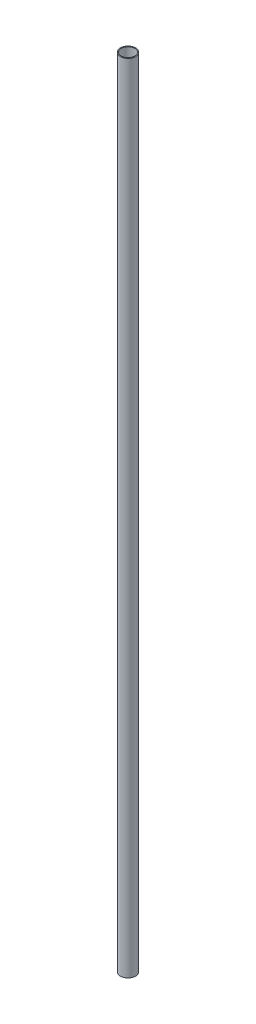
ISO-10303-21;
HEADER;
FILE_DESCRIPTION(('STEP AP214'),'2;1');
FILE_NAME('part.step','',(''),(''),'','','');
FILE_SCHEMA(('AUTOMOTIVE_DESIGN { 1 0 10303 214 1 1 1 1 }'));
ENDSEC;
DATA;
#1=APPLICATION_CONTEXT('core data for automotive mechanical design processes');
#2=APPLICATION_PROTOCOL_DEFINITION('international standard','automotive_design',2000,#1);
#3=PRODUCT_CONTEXT('',#1,'mechanical');
#4=PRODUCT('Part','Part','',(#3));
#5=PRODUCT_RELATED_PRODUCT_CATEGORY('part','',(#4));
#6=PRODUCT_DEFINITION_FORMATION('','',#4);
#7=PRODUCT_DEFINITION_CONTEXT('part definition',#1,'design');
#8=PRODUCT_DEFINITION('design','',#6,#7);
#9=PRODUCT_DEFINITION_SHAPE('','',#8);
#10=(LENGTH_UNIT() NAMED_UNIT(*) SI_UNIT(.MILLI.,.METRE.));
#11=(NAMED_UNIT(*) PLANE_ANGLE_UNIT() SI_UNIT($,.RADIAN.));
#12=(NAMED_UNIT(*) SI_UNIT($,.STERADIAN.) SOLID_ANGLE_UNIT());
#13=UNCERTAINTY_MEASURE_WITH_UNIT(LENGTH_MEASURE(1.E-05),#10,'distance_accuracy_value','');
#14=(GEOMETRIC_REPRESENTATION_CONTEXT(3) GLOBAL_UNCERTAINTY_ASSIGNED_CONTEXT((#13)) GLOBAL_UNIT_ASSIGNED_CONTEXT((#10,
#11,#12)) REPRESENTATION_CONTEXT('',''));
#15=CARTESIAN_POINT('',(0.,0.,0.));
#16=DIRECTION('',(0.,0.,1.));
#17=DIRECTION('',(1.,0.,0.));
#18=AXIS2_PLACEMENT_3D('',#15,#16,#17);
#19=CARTESIAN_POINT('',(0.,-939.8,0.));
#20=DIRECTION('',(0.,1.,0.));
#21=DIRECTION('',(0.,0.,1.));
#22=AXIS2_PLACEMENT_3D('',#19,#20,#21);
#23=CYLINDRICAL_SURFACE('',#22,8.9662);
#24=CARTESIAN_POINT('',(0.,-939.8,0.));
#25=DIRECTION('',(0.,1.,0.));
#26=DIRECTION('',(0.,0.,1.));
#27=AXIS2_PLACEMENT_3D('',#24,#25,#26);
#28=CIRCLE('',#27,8.9662);
#29=CARTESIAN_POINT('',(0.,-939.8,8.9662));
#30=VERTEX_POINT('',#29);
#31=EDGE_CURVE('E10',#30,#30,#28,.T.);
#32=ORIENTED_EDGE('',*,*,#31,.T.);
#33=EDGE_LOOP('',(#32));
#34=FACE_BOUND('',#33,.T.);
#35=CARTESIAN_POINT('',(0.,0.,0.));
#36=DIRECTION('',(0.,1.,0.));
#37=DIRECTION('',(0.,0.,1.));
#38=AXIS2_PLACEMENT_3D('',#35,#36,#37);
#39=CIRCLE('',#38,8.9662);
#40=CARTESIAN_POINT('',(0.,0.,8.9662));
#41=VERTEX_POINT('',#40);
#42=EDGE_CURVE('E40',#41,#41,#39,.T.);
#43=ORIENTED_EDGE('',*,*,#42,.F.);
#44=EDGE_LOOP('',(#43));
#45=FACE_BOUND('',#44,.T.);
#46=ADVANCED_FACE('F37',(#34,#45),#23,.T.);
#47=CARTESIAN_POINT('',(0.,-939.8,0.));
#48=DIRECTION('',(0.,1.,0.));
#49=DIRECTION('',(0.,0.,1.));
#50=AXIS2_PLACEMENT_3D('',#47,#48,#49);
#51=PLANE('',#50);
#52=CARTESIAN_POINT('',(0.,-939.8,0.));
#53=DIRECTION('',(0.,1.,0.));
#54=DIRECTION('',(0.,0.,1.));
#55=AXIS2_PLACEMENT_3D('',#52,#53,#54);
#56=CIRCLE('',#55,7.8994);
#57=CARTESIAN_POINT('',(0.,-939.8,7.8994));
#58=VERTEX_POINT('',#57);
#59=EDGE_CURVE('E47',#58,#58,#56,.T.);
#60=ORIENTED_EDGE('',*,*,#59,.T.);
#61=EDGE_LOOP('',(#60));
#62=FACE_BOUND('',#61,.T.);
#63=ORIENTED_EDGE('',*,*,#31,.F.);
#64=EDGE_LOOP('',(#63));
#65=FACE_BOUND('',#64,.T.);
#66=ADVANCED_FACE('F55',(#62,#65),#51,.F.);
#67=CARTESIAN_POINT('',(0.,0.,0.));
#68=DIRECTION('',(0.,1.,0.));
#69=DIRECTION('',(0.,0.,1.));
#70=AXIS2_PLACEMENT_3D('',#67,#68,#69);
#71=PLANE('',#70);
#72=CARTESIAN_POINT('',(0.,0.,0.));
#73=DIRECTION('',(0.,1.,0.));
#74=DIRECTION('',(0.,0.,1.));
#75=AXIS2_PLACEMENT_3D('',#72,#73,#74);
#76=CIRCLE('',#75,7.8994);
#77=CARTESIAN_POINT('',(0.,0.,7.8994));
#78=VERTEX_POINT('',#77);
#79=EDGE_CURVE('E49',#78,#78,#76,.T.);
#80=ORIENTED_EDGE('',*,*,#79,.F.);
#81=EDGE_LOOP('',(#80));
#82=FACE_BOUND('',#81,.T.);
#83=ORIENTED_EDGE('',*,*,#42,.T.);
#84=EDGE_LOOP('',(#83));
#85=FACE_BOUND('',#84,.T.);
#86=ADVANCED_FACE('F61',(#82,#85),#71,.T.);
#87=CARTESIAN_POINT('',(0.,-939.8,0.));
#88=DIRECTION('',(0.,1.,0.));
#89=DIRECTION('',(0.,0.,1.));
#90=AXIS2_PLACEMENT_3D('',#87,#88,#89);
#91=CYLINDRICAL_SURFACE('',#90,7.8994);
#92=ORIENTED_EDGE('',*,*,#59,.F.);
#93=EDGE_LOOP('',(#92));
#94=FACE_BOUND('',#93,.T.);
#95=ORIENTED_EDGE('',*,*,#79,.T.);
#96=EDGE_LOOP('',(#95));
#97=FACE_BOUND('',#96,.T.);
#98=ADVANCED_FACE('F58',(#94,#97),#91,.F.);
#99=CLOSED_SHELL('',(#46,#66,#86,#98));
#100=MANIFOLD_SOLID_BREP('B2',#99);
#101=ADVANCED_BREP_SHAPE_REPRESENTATION('',(#18,#100),#14);
#102=SHAPE_DEFINITION_REPRESENTATION(#9,#101);
ENDSEC;
END-ISO-10303-21;
